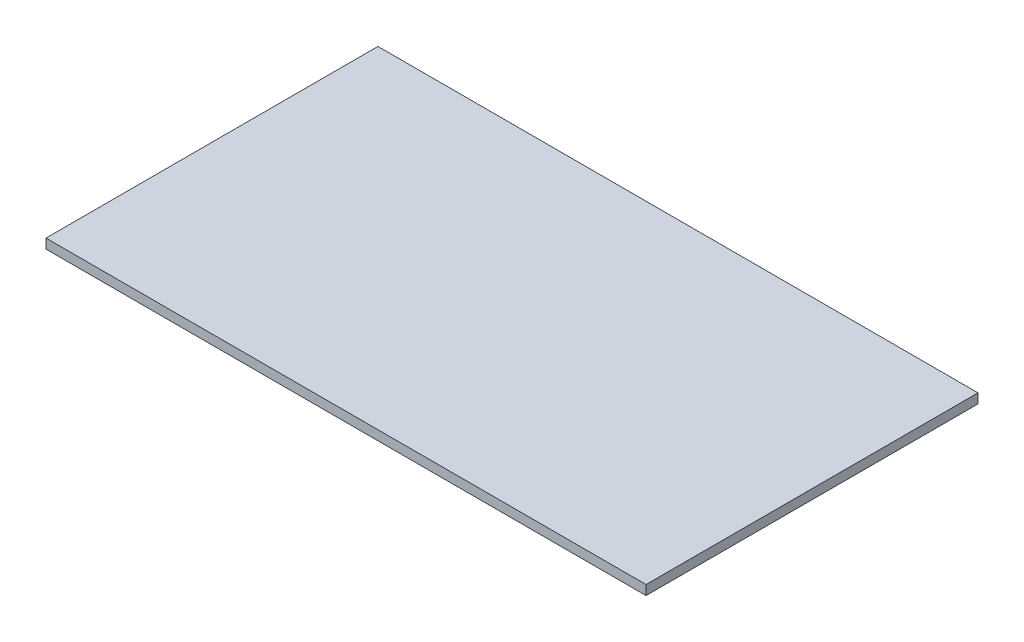
ISO-10303-21;
HEADER;
FILE_DESCRIPTION(('STEP AP214'),'2;1');
FILE_NAME('part.step','',(''),(''),'','','');
FILE_SCHEMA(('AUTOMOTIVE_DESIGN { 1 0 10303 214 1 1 1 1 }'));
ENDSEC;
DATA;
#1=APPLICATION_CONTEXT('core data for automotive mechanical design processes');
#2=APPLICATION_PROTOCOL_DEFINITION('international standard','automotive_design',2000,#1);
#3=PRODUCT_CONTEXT('',#1,'mechanical');
#4=PRODUCT('Part','Part','',(#3));
#5=PRODUCT_RELATED_PRODUCT_CATEGORY('part','',(#4));
#6=PRODUCT_DEFINITION_FORMATION('','',#4);
#7=PRODUCT_DEFINITION_CONTEXT('part definition',#1,'design');
#8=PRODUCT_DEFINITION('design','',#6,#7);
#9=PRODUCT_DEFINITION_SHAPE('','',#8);
#10=(LENGTH_UNIT() NAMED_UNIT(*) SI_UNIT(.MILLI.,.METRE.));
#11=(NAMED_UNIT(*) PLANE_ANGLE_UNIT() SI_UNIT($,.RADIAN.));
#12=(NAMED_UNIT(*) SI_UNIT($,.STERADIAN.) SOLID_ANGLE_UNIT());
#13=UNCERTAINTY_MEASURE_WITH_UNIT(LENGTH_MEASURE(1.E-05),#10,'distance_accuracy_value','');
#14=(GEOMETRIC_REPRESENTATION_CONTEXT(3) GLOBAL_UNCERTAINTY_ASSIGNED_CONTEXT((#13)) GLOBAL_UNIT_ASSIGNED_CONTEXT((#10,
#11,#12)) REPRESENTATION_CONTEXT('',''));
#15=CARTESIAN_POINT('',(0.,0.,0.));
#16=DIRECTION('',(0.,0.,1.));
#17=DIRECTION('',(1.,0.,0.));
#18=AXIS2_PLACEMENT_3D('',#15,#16,#17);
#19=CARTESIAN_POINT('',(0.,4.7625,0.));
#20=DIRECTION('',(1.,0.,0.));
#21=DIRECTION('',(0.,0.,-1.));
#22=AXIS2_PLACEMENT_3D('',#19,#20,#21);
#23=PLANE('',#22);
#24=DIRECTION('',(0.,0.,1.));
#25=VECTOR('',#24,1.);
#26=CARTESIAN_POINT('',(0.,0.,0.));
#27=LINE('',#26,#25);
#28=CARTESIAN_POINT('',(0.,0.,0.));
#29=VERTEX_POINT('',#28);
#30=CARTESIAN_POINT('',(1.43683632595776E-13,0.,165.1));
#31=VERTEX_POINT('',#30);
#32=EDGE_CURVE('E96',#29,#31,#27,.T.);
#33=ORIENTED_EDGE('',*,*,#32,.T.);
#34=DIRECTION('',(0.,-1.,0.));
#35=VECTOR('',#34,1.);
#36=CARTESIAN_POINT('',(1.43683632595776E-13,4.7625,165.1));
#37=LINE('',#36,#35);
#38=CARTESIAN_POINT('',(1.43683632595776E-13,4.7625,165.1));
#39=VERTEX_POINT('',#38);
#40=EDGE_CURVE('E11',#39,#31,#37,.T.);
#41=ORIENTED_EDGE('',*,*,#40,.F.);
#42=DIRECTION('',(0.,0.,1.));
#43=VECTOR('',#42,1.);
#44=CARTESIAN_POINT('',(0.,4.7625,0.));
#45=LINE('',#44,#43);
#46=CARTESIAN_POINT('',(0.,4.7625,0.));
#47=VERTEX_POINT('',#46);
#48=EDGE_CURVE('E82',#47,#39,#45,.T.);
#49=ORIENTED_EDGE('',*,*,#48,.F.);
#50=DIRECTION('',(0.,-1.,0.));
#51=VECTOR('',#50,1.);
#52=CARTESIAN_POINT('',(0.,4.7625,0.));
#53=LINE('',#52,#51);
#54=EDGE_CURVE('E49',#47,#29,#53,.T.);
#55=ORIENTED_EDGE('',*,*,#54,.T.);
#56=EDGE_LOOP('',(#33,#41,#49,#55));
#57=FACE_BOUND('',#56,.T.);
#58=ADVANCED_FACE('F33',(#57),#23,.F.);
#59=CARTESIAN_POINT('',(1.43683632595776E-13,4.7625,165.1));
#60=DIRECTION('',(0.,0.,-1.));
#61=DIRECTION('',(-1.,0.,0.));
#62=AXIS2_PLACEMENT_3D('',#59,#60,#61);
#63=PLANE('',#62);
#64=DIRECTION('',(1.,0.,0.));
#65=VECTOR('',#64,1.);
#66=CARTESIAN_POINT('',(1.43683632595776E-13,0.,165.1));
#67=LINE('',#66,#65);
#68=CARTESIAN_POINT('',(298.45,0.,165.1));
#69=VERTEX_POINT('',#68);
#70=EDGE_CURVE('E87',#31,#69,#67,.T.);
#71=ORIENTED_EDGE('',*,*,#70,.T.);
#72=DIRECTION('',(0.,-1.,0.));
#73=VECTOR('',#72,1.);
#74=CARTESIAN_POINT('',(298.45,4.7625,165.1));
#75=LINE('',#74,#73);
#76=CARTESIAN_POINT('',(298.45,4.7625,165.1));
#77=VERTEX_POINT('',#76);
#78=EDGE_CURVE('E41',#77,#69,#75,.T.);
#79=ORIENTED_EDGE('',*,*,#78,.F.);
#80=DIRECTION('',(1.,0.,0.));
#81=VECTOR('',#80,1.);
#82=CARTESIAN_POINT('',(1.43683632595776E-13,4.7625,165.1));
#83=LINE('',#82,#81);
#84=EDGE_CURVE('E74',#39,#77,#83,.T.);
#85=ORIENTED_EDGE('',*,*,#84,.F.);
#86=ORIENTED_EDGE('',*,*,#40,.T.);
#87=EDGE_LOOP('',(#71,#79,#85,#86));
#88=FACE_BOUND('',#87,.T.);
#89=ADVANCED_FACE('F86',(#88),#63,.F.);
#90=CARTESIAN_POINT('',(298.45,4.7625,0.));
#91=DIRECTION('',(1.,0.,0.));
#92=DIRECTION('',(0.,0.,-1.));
#93=AXIS2_PLACEMENT_3D('',#90,#91,#92);
#94=PLANE('',#93);
#95=DIRECTION('',(0.,0.,1.));
#96=VECTOR('',#95,1.);
#97=CARTESIAN_POINT('',(298.45,0.,0.));
#98=LINE('',#97,#96);
#99=CARTESIAN_POINT('',(298.45,0.,0.));
#100=VERTEX_POINT('',#99);
#101=EDGE_CURVE('E99',#100,#69,#98,.T.);
#102=ORIENTED_EDGE('',*,*,#101,.F.);
#103=DIRECTION('',(0.,-1.,0.));
#104=VECTOR('',#103,1.);
#105=CARTESIAN_POINT('',(298.45,4.7625,0.));
#106=LINE('',#105,#104);
#107=CARTESIAN_POINT('',(298.45,4.7625,0.));
#108=VERTEX_POINT('',#107);
#109=EDGE_CURVE('E63',#108,#100,#106,.T.);
#110=ORIENTED_EDGE('',*,*,#109,.F.);
#111=DIRECTION('',(0.,0.,1.));
#112=VECTOR('',#111,1.);
#113=CARTESIAN_POINT('',(298.45,4.7625,0.));
#114=LINE('',#113,#112);
#115=EDGE_CURVE('E81',#108,#77,#114,.T.);
#116=ORIENTED_EDGE('',*,*,#115,.T.);
#117=ORIENTED_EDGE('',*,*,#78,.T.);
#118=EDGE_LOOP('',(#102,#110,#116,#117));
#119=FACE_BOUND('',#118,.T.);
#120=ADVANCED_FACE('F90',(#119),#94,.T.);
#121=CARTESIAN_POINT('',(0.,4.7625,0.));
#122=DIRECTION('',(0.,0.,-1.));
#123=DIRECTION('',(-1.,0.,0.));
#124=AXIS2_PLACEMENT_3D('',#121,#122,#123);
#125=PLANE('',#124);
#126=DIRECTION('',(1.,0.,0.));
#127=VECTOR('',#126,1.);
#128=CARTESIAN_POINT('',(0.,0.,0.));
#129=LINE('',#128,#127);
#130=EDGE_CURVE('E101',#29,#100,#129,.T.);
#131=ORIENTED_EDGE('',*,*,#130,.F.);
#132=ORIENTED_EDGE('',*,*,#54,.F.);
#133=DIRECTION('',(1.,0.,0.));
#134=VECTOR('',#133,1.);
#135=CARTESIAN_POINT('',(0.,4.7625,0.));
#136=LINE('',#135,#134);
#137=EDGE_CURVE('E91',#47,#108,#136,.T.);
#138=ORIENTED_EDGE('',*,*,#137,.T.);
#139=ORIENTED_EDGE('',*,*,#109,.T.);
#140=EDGE_LOOP('',(#131,#132,#138,#139));
#141=FACE_BOUND('',#140,.T.);
#142=ADVANCED_FACE('F107',(#141),#125,.T.);
#143=CARTESIAN_POINT('',(0.,4.7625,0.));
#144=DIRECTION('',(0.,1.,0.));
#145=DIRECTION('',(0.,0.,1.));
#146=AXIS2_PLACEMENT_3D('',#143,#144,#145);
#147=PLANE('',#146);
#148=ORIENTED_EDGE('',*,*,#48,.T.);
#149=ORIENTED_EDGE('',*,*,#84,.T.);
#150=ORIENTED_EDGE('',*,*,#115,.F.);
#151=ORIENTED_EDGE('',*,*,#137,.F.);
#152=EDGE_LOOP('',(#148,#149,#150,#151));
#153=FACE_BOUND('',#152,.T.);
#154=ADVANCED_FACE('F78',(#153),#147,.T.);
#155=CARTESIAN_POINT('',(0.,0.,0.));
#156=DIRECTION('',(0.,1.,0.));
#157=DIRECTION('',(0.,0.,1.));
#158=AXIS2_PLACEMENT_3D('',#155,#156,#157);
#159=PLANE('',#158);
#160=ORIENTED_EDGE('',*,*,#32,.F.);
#161=ORIENTED_EDGE('',*,*,#130,.T.);
#162=ORIENTED_EDGE('',*,*,#101,.T.);
#163=ORIENTED_EDGE('',*,*,#70,.F.);
#164=EDGE_LOOP('',(#160,#161,#162,#163));
#165=FACE_BOUND('',#164,.T.);
#166=ADVANCED_FACE('F106',(#165),#159,.F.);
#167=CLOSED_SHELL('',(#58,#89,#120,#142,#154,#166));
#168=MANIFOLD_SOLID_BREP('B2',#167);
#169=ADVANCED_BREP_SHAPE_REPRESENTATION('',(#18,#168),#14);
#170=SHAPE_DEFINITION_REPRESENTATION(#9,#169);
ENDSEC;
END-ISO-10303-21;
